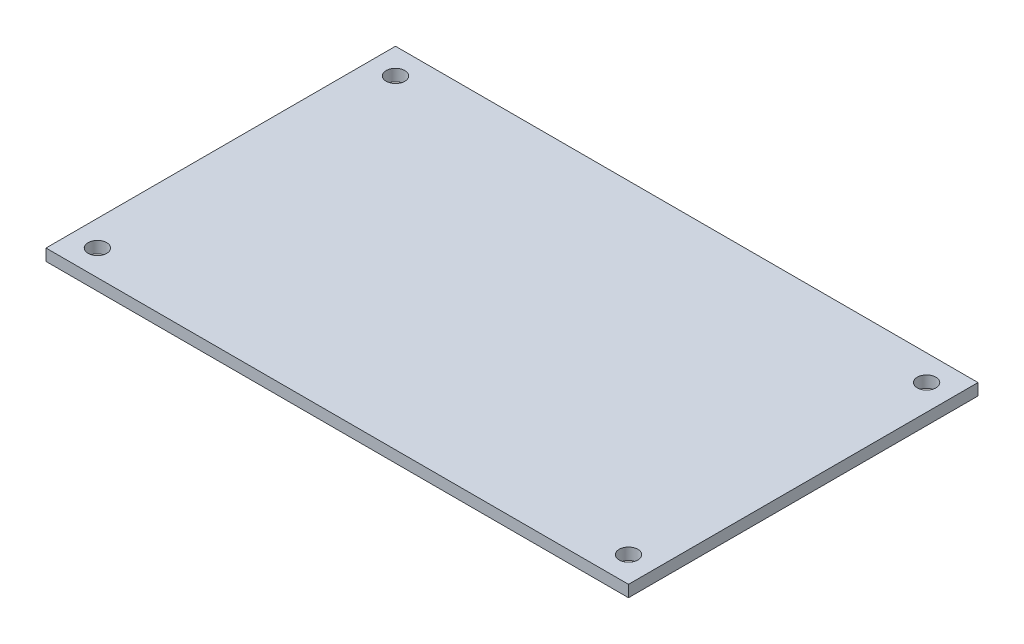
ISO-10303-21;
HEADER;
FILE_DESCRIPTION(('STEP AP214'),'2;1');
FILE_NAME('part.step','',(''),(''),'','','');
FILE_SCHEMA(('AUTOMOTIVE_DESIGN { 1 0 10303 214 1 1 1 1 }'));
ENDSEC;
DATA;
#1=APPLICATION_CONTEXT('core data for automotive mechanical design processes');
#2=APPLICATION_PROTOCOL_DEFINITION('international standard','automotive_design',2000,#1);
#3=PRODUCT_CONTEXT('',#1,'mechanical');
#4=PRODUCT('Part','Part','',(#3));
#5=PRODUCT_RELATED_PRODUCT_CATEGORY('part','',(#4));
#6=PRODUCT_DEFINITION_FORMATION('','',#4);
#7=PRODUCT_DEFINITION_CONTEXT('part definition',#1,'design');
#8=PRODUCT_DEFINITION('design','',#6,#7);
#9=PRODUCT_DEFINITION_SHAPE('','',#8);
#10=(LENGTH_UNIT() NAMED_UNIT(*) SI_UNIT(.MILLI.,.METRE.));
#11=(NAMED_UNIT(*) PLANE_ANGLE_UNIT() SI_UNIT($,.RADIAN.));
#12=(NAMED_UNIT(*) SI_UNIT($,.STERADIAN.) SOLID_ANGLE_UNIT());
#13=UNCERTAINTY_MEASURE_WITH_UNIT(LENGTH_MEASURE(1.E-05),#10,'distance_accuracy_value','');
#14=(GEOMETRIC_REPRESENTATION_CONTEXT(3) GLOBAL_UNCERTAINTY_ASSIGNED_CONTEXT((#13)) GLOBAL_UNIT_ASSIGNED_CONTEXT((#10,
#11,#12)) REPRESENTATION_CONTEXT('',''));
#15=CARTESIAN_POINT('',(0.,0.,0.));
#16=DIRECTION('',(0.,0.,1.));
#17=DIRECTION('',(1.,0.,0.));
#18=AXIS2_PLACEMENT_3D('',#15,#16,#17);
#19=CARTESIAN_POINT('',(0.,2.,0.));
#20=DIRECTION('',(0.,1.,0.));
#21=DIRECTION('',(0.,0.,1.));
#22=AXIS2_PLACEMENT_3D('',#19,#20,#21);
#23=PLANE('',#22);
#24=CARTESIAN_POINT('',(45.5876536853959,2.,25.5876536853959));
#25=DIRECTION('',(0.,1.,0.));
#26=DIRECTION('',(0.,0.,1.));
#27=AXIS2_PLACEMENT_3D('',#24,#25,#26);
#28=CIRCLE('',#27,1.6);
#29=CARTESIAN_POINT('',(45.5876536853959,2.,27.1876536853959));
#30=VERTEX_POINT('',#29);
#31=EDGE_CURVE('E142',#30,#30,#28,.T.);
#32=ORIENTED_EDGE('',*,*,#31,.F.);
#33=EDGE_LOOP('',(#32));
#34=FACE_BOUND('',#33,.T.);
#35=CARTESIAN_POINT('',(-45.5876536853959,2.,-25.587653685396));
#36=DIRECTION('',(0.,1.,0.));
#37=DIRECTION('',(0.,0.,1.));
#38=AXIS2_PLACEMENT_3D('',#35,#36,#37);
#39=CIRCLE('',#38,1.6);
#40=CARTESIAN_POINT('',(-45.5876536853959,2.,-23.987653685396));
#41=VERTEX_POINT('',#40);
#42=EDGE_CURVE('E112',#41,#41,#39,.T.);
#43=ORIENTED_EDGE('',*,*,#42,.F.);
#44=EDGE_LOOP('',(#43));
#45=FACE_BOUND('',#44,.T.);
#46=DIRECTION('',(0.,0.,1.));
#47=VECTOR('',#46,1.);
#48=CARTESIAN_POINT('',(-50.,2.,30.));
#49=LINE('',#48,#47);
#50=CARTESIAN_POINT('',(-50.,2.,-30.));
#51=VERTEX_POINT('',#50);
#52=CARTESIAN_POINT('',(-50.,2.,30.));
#53=VERTEX_POINT('',#52);
#54=EDGE_CURVE('E92',#51,#53,#49,.T.);
#55=ORIENTED_EDGE('',*,*,#54,.T.);
#56=DIRECTION('',(1.,0.,0.));
#57=VECTOR('',#56,1.);
#58=CARTESIAN_POINT('',(50.,2.,30.));
#59=LINE('',#58,#57);
#60=CARTESIAN_POINT('',(50.,2.,30.));
#61=VERTEX_POINT('',#60);
#62=EDGE_CURVE('E87',#53,#61,#59,.T.);
#63=ORIENTED_EDGE('',*,*,#62,.T.);
#64=DIRECTION('',(0.,0.,-1.));
#65=VECTOR('',#64,1.);
#66=CARTESIAN_POINT('',(50.,2.,30.));
#67=LINE('',#66,#65);
#68=CARTESIAN_POINT('',(50.,2.,-30.));
#69=VERTEX_POINT('',#68);
#70=EDGE_CURVE('E90',#61,#69,#67,.T.);
#71=ORIENTED_EDGE('',*,*,#70,.T.);
#72=DIRECTION('',(-1.,0.,0.));
#73=VECTOR('',#72,1.);
#74=CARTESIAN_POINT('',(50.,2.,-30.));
#75=LINE('',#74,#73);
#76=EDGE_CURVE('E57',#69,#51,#75,.T.);
#77=ORIENTED_EDGE('',*,*,#76,.T.);
#78=EDGE_LOOP('',(#55,#63,#71,#77));
#79=FACE_BOUND('',#78,.T.);
#80=CARTESIAN_POINT('',(45.5876536853959,2.,-25.587653685396));
#81=DIRECTION('',(0.,1.,0.));
#82=DIRECTION('',(0.,0.,-1.));
#83=AXIS2_PLACEMENT_3D('',#80,#81,#82);
#84=CIRCLE('',#83,1.6);
#85=CARTESIAN_POINT('',(45.5876536853959,2.,-27.187653685396));
#86=VERTEX_POINT('',#85);
#87=EDGE_CURVE('E134',#86,#86,#84,.T.);
#88=ORIENTED_EDGE('',*,*,#87,.F.);
#89=EDGE_LOOP('',(#88));
#90=FACE_BOUND('',#89,.T.);
#91=CARTESIAN_POINT('',(-45.5876536853959,2.,25.587653685396));
#92=DIRECTION('',(0.,1.,0.));
#93=DIRECTION('',(0.,0.,-1.));
#94=AXIS2_PLACEMENT_3D('',#91,#92,#93);
#95=CIRCLE('',#94,1.6);
#96=CARTESIAN_POINT('',(-45.5876536853959,2.,23.987653685396));
#97=VERTEX_POINT('',#96);
#98=EDGE_CURVE('E150',#97,#97,#95,.T.);
#99=ORIENTED_EDGE('',*,*,#98,.F.);
#100=EDGE_LOOP('',(#99));
#101=FACE_BOUND('',#100,.T.);
#102=ADVANCED_FACE('F39',(#34,#45,#79,#90,#101),#23,.T.);
#103=CARTESIAN_POINT('',(0.,0.,0.));
#104=DIRECTION('',(0.,1.,0.));
#105=DIRECTION('',(0.,0.,1.));
#106=AXIS2_PLACEMENT_3D('',#103,#104,#105);
#107=PLANE('',#106);
#108=DIRECTION('',(0.,0.,1.));
#109=VECTOR('',#108,1.);
#110=CARTESIAN_POINT('',(-50.,0.,30.));
#111=LINE('',#110,#109);
#112=CARTESIAN_POINT('',(-50.,0.,-30.));
#113=VERTEX_POINT('',#112);
#114=CARTESIAN_POINT('',(-50.,0.,30.));
#115=VERTEX_POINT('',#114);
#116=EDGE_CURVE('E108',#113,#115,#111,.T.);
#117=ORIENTED_EDGE('',*,*,#116,.F.);
#118=DIRECTION('',(-1.,0.,0.));
#119=VECTOR('',#118,1.);
#120=CARTESIAN_POINT('',(50.,0.,-30.));
#121=LINE('',#120,#119);
#122=CARTESIAN_POINT('',(50.,0.,-30.));
#123=VERTEX_POINT('',#122);
#124=EDGE_CURVE('E80',#123,#113,#121,.T.);
#125=ORIENTED_EDGE('',*,*,#124,.F.);
#126=DIRECTION('',(0.,0.,-1.));
#127=VECTOR('',#126,1.);
#128=CARTESIAN_POINT('',(50.,0.,30.));
#129=LINE('',#128,#127);
#130=CARTESIAN_POINT('',(50.,0.,30.));
#131=VERTEX_POINT('',#130);
#132=EDGE_CURVE('E74',#131,#123,#129,.T.);
#133=ORIENTED_EDGE('',*,*,#132,.F.);
#134=DIRECTION('',(1.,0.,0.));
#135=VECTOR('',#134,1.);
#136=CARTESIAN_POINT('',(50.,0.,30.));
#137=LINE('',#136,#135);
#138=EDGE_CURVE('E97',#115,#131,#137,.T.);
#139=ORIENTED_EDGE('',*,*,#138,.F.);
#140=EDGE_LOOP('',(#117,#125,#133,#139));
#141=FACE_BOUND('',#140,.T.);
#142=CARTESIAN_POINT('',(-45.5876536853959,0.,-25.587653685396));
#143=DIRECTION('',(0.,1.,0.));
#144=DIRECTION('',(0.,0.,1.));
#145=AXIS2_PLACEMENT_3D('',#142,#143,#144);
#146=CIRCLE('',#145,1.6);
#147=CARTESIAN_POINT('',(-45.5876536853959,0.,-23.987653685396));
#148=VERTEX_POINT('',#147);
#149=EDGE_CURVE('E130',#148,#148,#146,.T.);
#150=ORIENTED_EDGE('',*,*,#149,.T.);
#151=EDGE_LOOP('',(#150));
#152=FACE_BOUND('',#151,.T.);
#153=CARTESIAN_POINT('',(45.5876536853959,0.,-25.587653685396));
#154=DIRECTION('',(0.,1.,0.));
#155=DIRECTION('',(0.,0.,-1.));
#156=AXIS2_PLACEMENT_3D('',#153,#154,#155);
#157=CIRCLE('',#156,1.6);
#158=CARTESIAN_POINT('',(45.5876536853959,0.,-27.187653685396));
#159=VERTEX_POINT('',#158);
#160=EDGE_CURVE('E138',#159,#159,#157,.T.);
#161=ORIENTED_EDGE('',*,*,#160,.T.);
#162=EDGE_LOOP('',(#161));
#163=FACE_BOUND('',#162,.T.);
#164=CARTESIAN_POINT('',(45.5876536853959,0.,25.5876536853959));
#165=DIRECTION('',(0.,1.,0.));
#166=DIRECTION('',(0.,0.,1.));
#167=AXIS2_PLACEMENT_3D('',#164,#165,#166);
#168=CIRCLE('',#167,1.6);
#169=CARTESIAN_POINT('',(45.5876536853959,0.,27.1876536853959));
#170=VERTEX_POINT('',#169);
#171=EDGE_CURVE('E146',#170,#170,#168,.T.);
#172=ORIENTED_EDGE('',*,*,#171,.T.);
#173=EDGE_LOOP('',(#172));
#174=FACE_BOUND('',#173,.T.);
#175=CARTESIAN_POINT('',(-45.5876536853959,0.,25.587653685396));
#176=DIRECTION('',(0.,1.,0.));
#177=DIRECTION('',(0.,0.,-1.));
#178=AXIS2_PLACEMENT_3D('',#175,#176,#177);
#179=CIRCLE('',#178,1.6);
#180=CARTESIAN_POINT('',(-45.5876536853959,0.,23.987653685396));
#181=VERTEX_POINT('',#180);
#182=EDGE_CURVE('E154',#181,#181,#179,.T.);
#183=ORIENTED_EDGE('',*,*,#182,.T.);
#184=EDGE_LOOP('',(#183));
#185=FACE_BOUND('',#184,.T.);
#186=ADVANCED_FACE('F125',(#141,#152,#163,#174,#185),#107,.F.);
#187=CARTESIAN_POINT('',(-50.,2.,30.));
#188=DIRECTION('',(1.,0.,0.));
#189=DIRECTION('',(0.,0.,-1.));
#190=AXIS2_PLACEMENT_3D('',#187,#188,#189);
#191=PLANE('',#190);
#192=ORIENTED_EDGE('',*,*,#116,.T.);
#193=DIRECTION('',(0.,-1.,0.));
#194=VECTOR('',#193,1.);
#195=CARTESIAN_POINT('',(-50.,2.,30.));
#196=LINE('',#195,#194);
#197=EDGE_CURVE('E11',#53,#115,#196,.T.);
#198=ORIENTED_EDGE('',*,*,#197,.F.);
#199=ORIENTED_EDGE('',*,*,#54,.F.);
#200=DIRECTION('',(0.,-1.,0.));
#201=VECTOR('',#200,1.);
#202=CARTESIAN_POINT('',(-50.,2.,-30.));
#203=LINE('',#202,#201);
#204=EDGE_CURVE('E104',#51,#113,#203,.T.);
#205=ORIENTED_EDGE('',*,*,#204,.T.);
#206=EDGE_LOOP('',(#192,#198,#199,#205));
#207=FACE_BOUND('',#206,.T.);
#208=ADVANCED_FACE('F41',(#207),#191,.F.);
#209=CARTESIAN_POINT('',(50.,2.,30.));
#210=DIRECTION('',(0.,0.,-1.));
#211=DIRECTION('',(-1.,0.,0.));
#212=AXIS2_PLACEMENT_3D('',#209,#210,#211);
#213=PLANE('',#212);
#214=ORIENTED_EDGE('',*,*,#138,.T.);
#215=DIRECTION('',(0.,-1.,0.));
#216=VECTOR('',#215,1.);
#217=CARTESIAN_POINT('',(50.,2.,30.));
#218=LINE('',#217,#216);
#219=EDGE_CURVE('E49',#61,#131,#218,.T.);
#220=ORIENTED_EDGE('',*,*,#219,.F.);
#221=ORIENTED_EDGE('',*,*,#62,.F.);
#222=ORIENTED_EDGE('',*,*,#197,.T.);
#223=EDGE_LOOP('',(#214,#220,#221,#222));
#224=FACE_BOUND('',#223,.T.);
#225=ADVANCED_FACE('F96',(#224),#213,.F.);
#226=CARTESIAN_POINT('',(50.,2.,30.));
#227=DIRECTION('',(-1.,0.,0.));
#228=DIRECTION('',(0.,0.,1.));
#229=AXIS2_PLACEMENT_3D('',#226,#227,#228);
#230=PLANE('',#229);
#231=ORIENTED_EDGE('',*,*,#132,.T.);
#232=DIRECTION('',(0.,-1.,0.));
#233=VECTOR('',#232,1.);
#234=CARTESIAN_POINT('',(50.,2.,-30.));
#235=LINE('',#234,#233);
#236=EDGE_CURVE('E99',#69,#123,#235,.T.);
#237=ORIENTED_EDGE('',*,*,#236,.F.);
#238=ORIENTED_EDGE('',*,*,#70,.F.);
#239=ORIENTED_EDGE('',*,*,#219,.T.);
#240=EDGE_LOOP('',(#231,#237,#238,#239));
#241=FACE_BOUND('',#240,.T.);
#242=ADVANCED_FACE('F100',(#241),#230,.F.);
#243=CARTESIAN_POINT('',(50.,2.,-30.));
#244=DIRECTION('',(0.,0.,1.));
#245=DIRECTION('',(1.,0.,0.));
#246=AXIS2_PLACEMENT_3D('',#243,#244,#245);
#247=PLANE('',#246);
#248=ORIENTED_EDGE('',*,*,#124,.T.);
#249=ORIENTED_EDGE('',*,*,#204,.F.);
#250=ORIENTED_EDGE('',*,*,#76,.F.);
#251=ORIENTED_EDGE('',*,*,#236,.T.);
#252=EDGE_LOOP('',(#248,#249,#250,#251));
#253=FACE_BOUND('',#252,.T.);
#254=ADVANCED_FACE('F122',(#253),#247,.F.);
#255=CARTESIAN_POINT('',(-45.5876536853959,2.,-25.587653685396));
#256=DIRECTION('',(0.,-1.,0.));
#257=DIRECTION('',(0.,0.,-1.));
#258=AXIS2_PLACEMENT_3D('',#255,#256,#257);
#259=CYLINDRICAL_SURFACE('',#258,1.6);
#260=ORIENTED_EDGE('',*,*,#42,.T.);
#261=EDGE_LOOP('',(#260));
#262=FACE_BOUND('',#261,.T.);
#263=ORIENTED_EDGE('',*,*,#149,.F.);
#264=EDGE_LOOP('',(#263));
#265=FACE_BOUND('',#264,.T.);
#266=ADVANCED_FACE('F175',(#262,#265),#259,.F.);
#267=CARTESIAN_POINT('',(45.5876536853959,2.,-25.587653685396));
#268=DIRECTION('',(0.,-1.,0.));
#269=DIRECTION('',(0.,0.,-1.));
#270=AXIS2_PLACEMENT_3D('',#267,#268,#269);
#271=CYLINDRICAL_SURFACE('',#270,1.6);
#272=ORIENTED_EDGE('',*,*,#87,.T.);
#273=EDGE_LOOP('',(#272));
#274=FACE_BOUND('',#273,.T.);
#275=ORIENTED_EDGE('',*,*,#160,.F.);
#276=EDGE_LOOP('',(#275));
#277=FACE_BOUND('',#276,.T.);
#278=ADVANCED_FACE('F221',(#274,#277),#271,.F.);
#279=CARTESIAN_POINT('',(45.5876536853959,2.,25.5876536853959));
#280=DIRECTION('',(0.,-1.,0.));
#281=DIRECTION('',(0.,0.,-1.));
#282=AXIS2_PLACEMENT_3D('',#279,#280,#281);
#283=CYLINDRICAL_SURFACE('',#282,1.6);
#284=ORIENTED_EDGE('',*,*,#31,.T.);
#285=EDGE_LOOP('',(#284));
#286=FACE_BOUND('',#285,.T.);
#287=ORIENTED_EDGE('',*,*,#171,.F.);
#288=EDGE_LOOP('',(#287));
#289=FACE_BOUND('',#288,.T.);
#290=ADVANCED_FACE('F229',(#286,#289),#283,.F.);
#291=CARTESIAN_POINT('',(-45.5876536853959,2.,25.587653685396));
#292=DIRECTION('',(0.,-1.,0.));
#293=DIRECTION('',(0.,0.,-1.));
#294=AXIS2_PLACEMENT_3D('',#291,#292,#293);
#295=CYLINDRICAL_SURFACE('',#294,1.6);
#296=ORIENTED_EDGE('',*,*,#98,.T.);
#297=EDGE_LOOP('',(#296));
#298=FACE_BOUND('',#297,.T.);
#299=ORIENTED_EDGE('',*,*,#182,.F.);
#300=EDGE_LOOP('',(#299));
#301=FACE_BOUND('',#300,.T.);
#302=ADVANCED_FACE('F162',(#298,#301),#295,.F.);
#303=CLOSED_SHELL('',(#102,#186,#208,#225,#242,#254,#266,#278,#290,#302));
#304=MANIFOLD_SOLID_BREP('B2',#303);
#305=ADVANCED_BREP_SHAPE_REPRESENTATION('',(#18,#304),#14);
#306=SHAPE_DEFINITION_REPRESENTATION(#9,#305);
ENDSEC;
END-ISO-10303-21;
